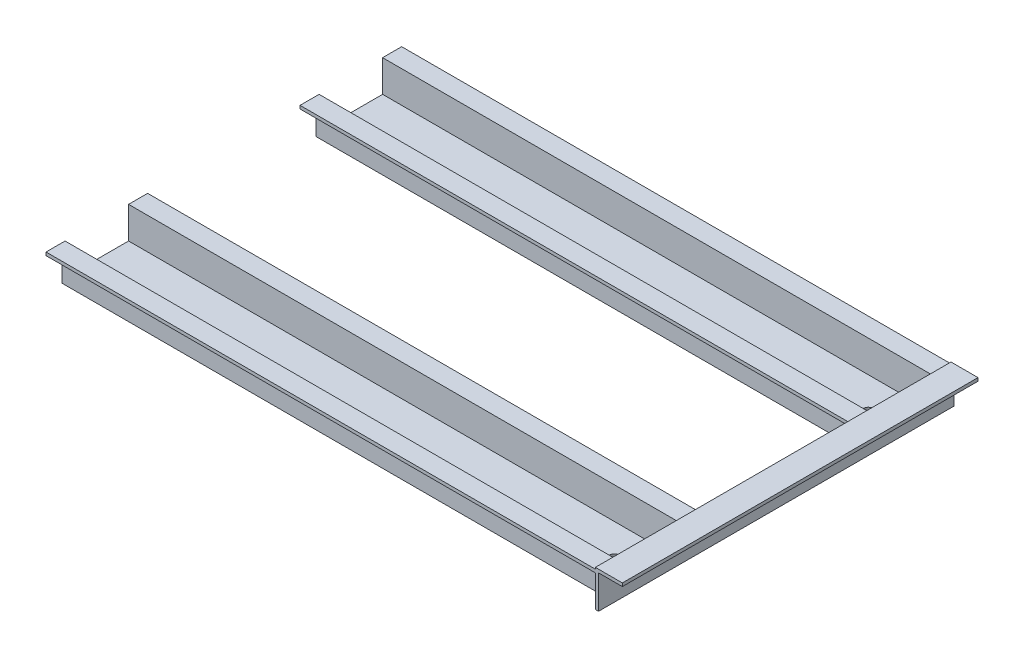
ISO-10303-21;
HEADER;
FILE_DESCRIPTION(('STEP AP214'),'2;1');
FILE_NAME('part.step','',(''),(''),'','','');
FILE_SCHEMA(('AUTOMOTIVE_DESIGN { 1 0 10303 214 1 1 1 1 }'));
ENDSEC;
DATA;
#1=APPLICATION_CONTEXT('core data for automotive mechanical design processes');
#2=APPLICATION_PROTOCOL_DEFINITION('international standard','automotive_design',2000,#1);
#3=PRODUCT_CONTEXT('',#1,'mechanical');
#4=PRODUCT('Part','Part','',(#3));
#5=PRODUCT_RELATED_PRODUCT_CATEGORY('part','',(#4));
#6=PRODUCT_DEFINITION_FORMATION('','',#4);
#7=PRODUCT_DEFINITION_CONTEXT('part definition',#1,'design');
#8=PRODUCT_DEFINITION('design','',#6,#7);
#9=PRODUCT_DEFINITION_SHAPE('','',#8);
#10=(LENGTH_UNIT() NAMED_UNIT(*) SI_UNIT(.MILLI.,.METRE.));
#11=(NAMED_UNIT(*) PLANE_ANGLE_UNIT() SI_UNIT($,.RADIAN.));
#12=(NAMED_UNIT(*) SI_UNIT($,.STERADIAN.) SOLID_ANGLE_UNIT());
#13=UNCERTAINTY_MEASURE_WITH_UNIT(LENGTH_MEASURE(1.E-05),#10,'distance_accuracy_value','');
#14=(GEOMETRIC_REPRESENTATION_CONTEXT(3) GLOBAL_UNCERTAINTY_ASSIGNED_CONTEXT((#13)) GLOBAL_UNIT_ASSIGNED_CONTEXT((#10,
#11,#12)) REPRESENTATION_CONTEXT('',''));
#15=CARTESIAN_POINT('',(0.,0.,0.));
#16=DIRECTION('',(0.,0.,1.));
#17=DIRECTION('',(1.,0.,0.));
#18=AXIS2_PLACEMENT_3D('',#15,#16,#17);
#19=CARTESIAN_POINT('',(0.,0.,0.));
#20=DIRECTION('',(1.,0.,0.));
#21=DIRECTION('',(0.,0.,-1.));
#22=AXIS2_PLACEMENT_3D('',#19,#20,#21);
#23=PLANE('',#22);
#24=DIRECTION('',(0.,-1.,0.));
#25=VECTOR('',#24,1.);
#26=CARTESIAN_POINT('',(0.,20.,112.));
#27=LINE('',#26,#25);
#28=CARTESIAN_POINT('',(0.,22.,112.));
#29=VERTEX_POINT('',#28);
#30=CARTESIAN_POINT('',(0.,20.,112.));
#31=VERTEX_POINT('',#30);
#32=EDGE_CURVE('E540',#29,#31,#27,.T.);
#33=ORIENTED_EDGE('',*,*,#32,.F.);
#34=DIRECTION('',(0.,0.,-1.));
#35=VECTOR('',#34,1.);
#36=CARTESIAN_POINT('',(0.,22.,112.));
#37=LINE('',#36,#35);
#38=CARTESIAN_POINT('',(0.,22.,100.));
#39=VERTEX_POINT('',#38);
#40=EDGE_CURVE('E307',#29,#39,#37,.T.);
#41=ORIENTED_EDGE('',*,*,#40,.T.);
#42=DIRECTION('',(0.,-1.,0.));
#43=VECTOR('',#42,1.);
#44=CARTESIAN_POINT('',(0.,20.,100.));
#45=LINE('',#44,#43);
#46=CARTESIAN_POINT('',(0.,1.99999999999997,100.));
#47=VERTEX_POINT('',#46);
#48=EDGE_CURVE('E421',#39,#47,#45,.T.);
#49=ORIENTED_EDGE('',*,*,#48,.T.);
#50=DIRECTION('',(0.,0.,-1.));
#51=VECTOR('',#50,1.);
#52=CARTESIAN_POINT('',(0.,1.99999999999997,102.));
#53=LINE('',#52,#51);
#54=CARTESIAN_POINT('',(0.,1.99999999999997,60.));
#55=VERTEX_POINT('',#54);
#56=EDGE_CURVE('E423',#47,#55,#53,.T.);
#57=ORIENTED_EDGE('',*,*,#56,.T.);
#58=DIRECTION('',(0.,1.,0.));
#59=VECTOR('',#58,1.);
#60=CARTESIAN_POINT('',(0.,20.,60.));
#61=LINE('',#60,#59);
#62=CARTESIAN_POINT('',(0.,22.,60.));
#63=VERTEX_POINT('',#62);
#64=EDGE_CURVE('E427',#55,#63,#61,.T.);
#65=ORIENTED_EDGE('',*,*,#64,.T.);
#66=DIRECTION('',(0.,0.,-1.));
#67=VECTOR('',#66,1.);
#68=CARTESIAN_POINT('',(0.,22.,48.));
#69=LINE('',#68,#67);
#70=CARTESIAN_POINT('',(0.,22.,48.));
#71=VERTEX_POINT('',#70);
#72=EDGE_CURVE('E556',#63,#71,#69,.T.);
#73=ORIENTED_EDGE('',*,*,#72,.T.);
#74=DIRECTION('',(0.,1.,0.));
#75=VECTOR('',#74,1.);
#76=CARTESIAN_POINT('',(0.,22.,48.));
#77=LINE('',#76,#75);
#78=CARTESIAN_POINT('',(0.,20.,48.));
#79=VERTEX_POINT('',#78);
#80=EDGE_CURVE('E553',#79,#71,#77,.T.);
#81=ORIENTED_EDGE('',*,*,#80,.F.);
#82=DIRECTION('',(0.,0.,-1.));
#83=VECTOR('',#82,1.);
#84=CARTESIAN_POINT('',(0.,20.,48.));
#85=LINE('',#84,#83);
#86=CARTESIAN_POINT('',(0.,20.,58.));
#87=VERTEX_POINT('',#86);
#88=EDGE_CURVE('E550',#87,#79,#85,.T.);
#89=ORIENTED_EDGE('',*,*,#88,.F.);
#90=DIRECTION('',(0.,1.,0.));
#91=VECTOR('',#90,1.);
#92=CARTESIAN_POINT('',(0.,20.,58.));
#93=LINE('',#92,#91);
#94=CARTESIAN_POINT('',(0.,0.,58.));
#95=VERTEX_POINT('',#94);
#96=EDGE_CURVE('E547',#95,#87,#93,.T.);
#97=ORIENTED_EDGE('',*,*,#96,.F.);
#98=DIRECTION('',(0.,0.,-1.));
#99=VECTOR('',#98,1.);
#100=CARTESIAN_POINT('',(0.,0.,102.));
#101=LINE('',#100,#99);
#102=CARTESIAN_POINT('',(0.,0.,102.));
#103=VERTEX_POINT('',#102);
#104=EDGE_CURVE('E546',#103,#95,#101,.T.);
#105=ORIENTED_EDGE('',*,*,#104,.F.);
#106=DIRECTION('',(0.,-1.,0.));
#107=VECTOR('',#106,1.);
#108=CARTESIAN_POINT('',(0.,20.,102.));
#109=LINE('',#108,#107);
#110=CARTESIAN_POINT('',(0.,20.,102.));
#111=VERTEX_POINT('',#110);
#112=EDGE_CURVE('E543',#111,#103,#109,.T.);
#113=ORIENTED_EDGE('',*,*,#112,.F.);
#114=DIRECTION('',(0.,0.,-1.));
#115=VECTOR('',#114,1.);
#116=CARTESIAN_POINT('',(0.,20.,112.));
#117=LINE('',#116,#115);
#118=EDGE_CURVE('E69',#31,#111,#117,.T.);
#119=ORIENTED_EDGE('',*,*,#118,.F.);
#120=EDGE_LOOP('',(#33,#41,#49,#57,#65,#73,#81,#89,#97,#105,#113,#119));
#121=FACE_BOUND('',#120,.T.);
#122=ADVANCED_FACE('F54',(#121),#23,.F.);
#123=CARTESIAN_POINT('',(-413.675697262755,22.,112.));
#124=DIRECTION('',(0.,1.,0.));
#125=DIRECTION('',(0.,0.,1.));
#126=AXIS2_PLACEMENT_3D('',#123,#124,#125);
#127=PLANE('',#126);
#128=ORIENTED_EDGE('',*,*,#40,.F.);
#129=DIRECTION('',(1.,0.,0.));
#130=VECTOR('',#129,1.);
#131=CARTESIAN_POINT('',(-413.675697262755,22.,112.));
#132=LINE('',#131,#130);
#133=CARTESIAN_POINT('',(346.000000000001,22.,112.));
#134=VERTEX_POINT('',#133);
#135=EDGE_CURVE('E268',#29,#134,#132,.T.);
#136=ORIENTED_EDGE('',*,*,#135,.T.);
#137=DIRECTION('',(0.,0.,1.));
#138=VECTOR('',#137,1.);
#139=CARTESIAN_POINT('',(346.000000000001,22.,112.));
#140=LINE('',#139,#138);
#141=CARTESIAN_POINT('',(346.000000000001,22.,100.));
#142=VERTEX_POINT('',#141);
#143=EDGE_CURVE('E306',#142,#134,#140,.T.);
#144=ORIENTED_EDGE('',*,*,#143,.F.);
#145=DIRECTION('',(1.,0.,0.));
#146=VECTOR('',#145,1.);
#147=CARTESIAN_POINT('',(-413.675697262755,22.,100.));
#148=LINE('',#147,#146);
#149=EDGE_CURVE('E278',#39,#142,#148,.T.);
#150=ORIENTED_EDGE('',*,*,#149,.F.);
#151=EDGE_LOOP('',(#128,#136,#144,#150));
#152=FACE_BOUND('',#151,.T.);
#153=ADVANCED_FACE('F56',(#152),#127,.T.);
#154=CARTESIAN_POINT('',(-413.675697262755,20.,100.));
#155=DIRECTION('',(0.,0.,-1.));
#156=DIRECTION('',(-1.,0.,0.));
#157=AXIS2_PLACEMENT_3D('',#154,#155,#156);
#158=PLANE('',#157);
#159=ORIENTED_EDGE('',*,*,#48,.F.);
#160=ORIENTED_EDGE('',*,*,#149,.T.);
#161=DIRECTION('',(0.,1.,0.));
#162=VECTOR('',#161,1.);
#163=CARTESIAN_POINT('',(346.000000000001,20.,100.));
#164=LINE('',#163,#162);
#165=CARTESIAN_POINT('',(346.000000000001,1.99999999999997,100.));
#166=VERTEX_POINT('',#165);
#167=EDGE_CURVE('E326',#166,#142,#164,.T.);
#168=ORIENTED_EDGE('',*,*,#167,.F.);
#169=DIRECTION('',(1.,0.,0.));
#170=VECTOR('',#169,1.);
#171=CARTESIAN_POINT('',(-413.675697262755,1.99999999999997,100.));
#172=LINE('',#171,#170);
#173=EDGE_CURVE('E280',#47,#166,#172,.T.);
#174=ORIENTED_EDGE('',*,*,#173,.F.);
#175=EDGE_LOOP('',(#159,#160,#168,#174));
#176=FACE_BOUND('',#175,.T.);
#177=ADVANCED_FACE('F420',(#176),#158,.T.);
#178=CARTESIAN_POINT('',(-413.675697262755,1.99999999999997,102.));
#179=DIRECTION('',(0.,1.,0.));
#180=DIRECTION('',(0.,0.,1.));
#181=AXIS2_PLACEMENT_3D('',#178,#179,#180);
#182=PLANE('',#181);
#183=ORIENTED_EDGE('',*,*,#56,.F.);
#184=ORIENTED_EDGE('',*,*,#173,.T.);
#185=DIRECTION('',(0.,0.,1.));
#186=VECTOR('',#185,1.);
#187=CARTESIAN_POINT('',(346.000000000001,1.99999999999997,102.));
#188=LINE('',#187,#186);
#189=CARTESIAN_POINT('',(346.,1.99999999999997,60.));
#190=VERTEX_POINT('',#189);
#191=EDGE_CURVE('E329',#190,#166,#188,.T.);
#192=ORIENTED_EDGE('',*,*,#191,.F.);
#193=DIRECTION('',(1.,0.,0.));
#194=VECTOR('',#193,1.);
#195=CARTESIAN_POINT('',(-413.675697262755,1.99999999999997,60.));
#196=LINE('',#195,#194);
#197=EDGE_CURVE('E282',#55,#190,#196,.T.);
#198=ORIENTED_EDGE('',*,*,#197,.F.);
#199=EDGE_LOOP('',(#183,#184,#192,#198));
#200=FACE_BOUND('',#199,.T.);
#201=CARTESIAN_POINT('',(326.,1.99999999999997,80.));
#202=DIRECTION('',(0.,-1.,0.));
#203=DIRECTION('',(0.,0.,1.));
#204=AXIS2_PLACEMENT_3D('',#201,#202,#203);
#205=CIRCLE('',#204,3.30000000000003);
#206=CARTESIAN_POINT('',(326.,1.99999999999997,83.3000000000001));
#207=VERTEX_POINT('',#206);
#208=EDGE_CURVE('E327',#207,#207,#205,.T.);
#209=ORIENTED_EDGE('',*,*,#208,.T.);
#210=EDGE_LOOP('',(#209));
#211=FACE_BOUND('',#210,.T.);
#212=ADVANCED_FACE('F566',(#200,#211),#182,.T.);
#213=CARTESIAN_POINT('',(-413.675697262755,20.,60.));
#214=DIRECTION('',(0.,0.,1.));
#215=DIRECTION('',(1.,0.,0.));
#216=AXIS2_PLACEMENT_3D('',#213,#214,#215);
#217=PLANE('',#216);
#218=ORIENTED_EDGE('',*,*,#64,.F.);
#219=ORIENTED_EDGE('',*,*,#197,.T.);
#220=DIRECTION('',(0.,-1.,0.));
#221=VECTOR('',#220,1.);
#222=CARTESIAN_POINT('',(346.,20.,60.));
#223=LINE('',#222,#221);
#224=CARTESIAN_POINT('',(346.,22.,60.));
#225=VERTEX_POINT('',#224);
#226=EDGE_CURVE('E411',#225,#190,#223,.T.);
#227=ORIENTED_EDGE('',*,*,#226,.F.);
#228=DIRECTION('',(1.,0.,0.));
#229=VECTOR('',#228,1.);
#230=CARTESIAN_POINT('',(-413.675697262755,22.,60.));
#231=LINE('',#230,#229);
#232=EDGE_CURVE('E284',#63,#225,#231,.T.);
#233=ORIENTED_EDGE('',*,*,#232,.F.);
#234=EDGE_LOOP('',(#218,#219,#227,#233));
#235=FACE_BOUND('',#234,.T.);
#236=ADVANCED_FACE('F565',(#235),#217,.T.);
#237=CARTESIAN_POINT('',(-413.675697262755,22.,48.));
#238=DIRECTION('',(0.,1.,0.));
#239=DIRECTION('',(0.,0.,1.));
#240=AXIS2_PLACEMENT_3D('',#237,#238,#239);
#241=PLANE('',#240);
#242=ORIENTED_EDGE('',*,*,#72,.F.);
#243=ORIENTED_EDGE('',*,*,#232,.T.);
#244=DIRECTION('',(0.,0.,1.));
#245=VECTOR('',#244,1.);
#246=CARTESIAN_POINT('',(346.,22.,48.0000000000005));
#247=LINE('',#246,#245);
#248=CARTESIAN_POINT('',(346.,22.,48.));
#249=VERTEX_POINT('',#248);
#250=EDGE_CURVE('E408',#249,#225,#247,.T.);
#251=ORIENTED_EDGE('',*,*,#250,.F.);
#252=DIRECTION('',(1.,0.,0.));
#253=VECTOR('',#252,1.);
#254=CARTESIAN_POINT('',(-413.675697262755,22.,48.));
#255=LINE('',#254,#253);
#256=EDGE_CURVE('E286',#71,#249,#255,.T.);
#257=ORIENTED_EDGE('',*,*,#256,.F.);
#258=EDGE_LOOP('',(#242,#243,#251,#257));
#259=FACE_BOUND('',#258,.T.);
#260=ADVANCED_FACE('F563',(#259),#241,.T.);
#261=CARTESIAN_POINT('',(-413.675697262755,22.,48.));
#262=DIRECTION('',(0.,0.,1.));
#263=DIRECTION('',(1.,0.,0.));
#264=AXIS2_PLACEMENT_3D('',#261,#262,#263);
#265=PLANE('',#264);
#266=DIRECTION('',(1.,0.,0.));
#267=VECTOR('',#266,1.);
#268=CARTESIAN_POINT('',(-413.675697262755,20.,48.));
#269=LINE('',#268,#267);
#270=CARTESIAN_POINT('',(346.,20.,48.));
#271=VERTEX_POINT('',#270);
#272=EDGE_CURVE('E288',#79,#271,#269,.T.);
#273=ORIENTED_EDGE('',*,*,#272,.F.);
#274=ORIENTED_EDGE('',*,*,#80,.T.);
#275=ORIENTED_EDGE('',*,*,#256,.T.);
#276=DIRECTION('',(0.,-1.,0.));
#277=VECTOR('',#276,1.);
#278=CARTESIAN_POINT('',(346.,22.,48.));
#279=LINE('',#278,#277);
#280=EDGE_CURVE('E405',#249,#271,#279,.T.);
#281=ORIENTED_EDGE('',*,*,#280,.T.);
#282=EDGE_LOOP('',(#273,#274,#275,#281));
#283=FACE_BOUND('',#282,.T.);
#284=ADVANCED_FACE('F649',(#283),#265,.F.);
#285=CARTESIAN_POINT('',(-413.675697262755,20.,48.));
#286=DIRECTION('',(0.,1.,0.));
#287=DIRECTION('',(0.,0.,1.));
#288=AXIS2_PLACEMENT_3D('',#285,#286,#287);
#289=PLANE('',#288);
#290=DIRECTION('',(1.,0.,0.));
#291=VECTOR('',#290,1.);
#292=CARTESIAN_POINT('',(-413.675697262755,20.,58.));
#293=LINE('',#292,#291);
#294=CARTESIAN_POINT('',(346.,20.,58.));
#295=VERTEX_POINT('',#294);
#296=EDGE_CURVE('E290',#87,#295,#293,.T.);
#297=ORIENTED_EDGE('',*,*,#296,.F.);
#298=ORIENTED_EDGE('',*,*,#88,.T.);
#299=ORIENTED_EDGE('',*,*,#272,.T.);
#300=DIRECTION('',(0.,0.,1.));
#301=VECTOR('',#300,1.);
#302=CARTESIAN_POINT('',(346.,20.,48.0000000000005));
#303=LINE('',#302,#301);
#304=EDGE_CURVE('E402',#271,#295,#303,.T.);
#305=ORIENTED_EDGE('',*,*,#304,.T.);
#306=EDGE_LOOP('',(#297,#298,#299,#305));
#307=FACE_BOUND('',#306,.T.);
#308=ADVANCED_FACE('F645',(#307),#289,.F.);
#309=CARTESIAN_POINT('',(-413.675697262755,20.,58.));
#310=DIRECTION('',(0.,0.,1.));
#311=DIRECTION('',(1.,0.,0.));
#312=AXIS2_PLACEMENT_3D('',#309,#310,#311);
#313=PLANE('',#312);
#314=DIRECTION('',(1.,0.,0.));
#315=VECTOR('',#314,1.);
#316=CARTESIAN_POINT('',(-413.675697262755,0.,58.));
#317=LINE('',#316,#315);
#318=CARTESIAN_POINT('',(346.000000000001,0.,58.));
#319=VERTEX_POINT('',#318);
#320=EDGE_CURVE('E292',#95,#319,#317,.T.);
#321=ORIENTED_EDGE('',*,*,#320,.F.);
#322=ORIENTED_EDGE('',*,*,#96,.T.);
#323=ORIENTED_EDGE('',*,*,#296,.T.);
#324=DIRECTION('',(0.,-1.,0.));
#325=VECTOR('',#324,1.);
#326=CARTESIAN_POINT('',(346.,20.,58.));
#327=LINE('',#326,#325);
#328=EDGE_CURVE('E400',#295,#319,#327,.T.);
#329=ORIENTED_EDGE('',*,*,#328,.T.);
#330=EDGE_LOOP('',(#321,#322,#323,#329));
#331=FACE_BOUND('',#330,.T.);
#332=ADVANCED_FACE('F581',(#331),#313,.F.);
#333=CARTESIAN_POINT('',(-413.675697262755,0.,102.));
#334=DIRECTION('',(0.,1.,0.));
#335=DIRECTION('',(0.,0.,1.));
#336=AXIS2_PLACEMENT_3D('',#333,#334,#335);
#337=PLANE('',#336);
#338=DIRECTION('',(1.,0.,0.));
#339=VECTOR('',#338,1.);
#340=CARTESIAN_POINT('',(-413.675697262755,0.,102.));
#341=LINE('',#340,#339);
#342=CARTESIAN_POINT('',(346.000000000001,0.,102.));
#343=VERTEX_POINT('',#342);
#344=EDGE_CURVE('E294',#103,#343,#341,.T.);
#345=ORIENTED_EDGE('',*,*,#344,.F.);
#346=ORIENTED_EDGE('',*,*,#104,.T.);
#347=ORIENTED_EDGE('',*,*,#320,.T.);
#348=DIRECTION('',(0.,0.,1.));
#349=VECTOR('',#348,1.);
#350=CARTESIAN_POINT('',(345.999999999999,0.,-112.));
#351=LINE('',#350,#349);
#352=CARTESIAN_POINT('',(346.000000000001,0.,-58.));
#353=VERTEX_POINT('',#352);
#354=EDGE_CURVE('E362',#353,#319,#351,.T.);
#355=ORIENTED_EDGE('',*,*,#354,.F.);
#356=DIRECTION('',(1.,0.,0.));
#357=VECTOR('',#356,1.);
#358=CARTESIAN_POINT('',(-413.675697262755,0.,-58.));
#359=LINE('',#358,#357);
#360=CARTESIAN_POINT('',(0.,0.,-58.));
#361=VERTEX_POINT('',#360);
#362=EDGE_CURVE('E270',#361,#353,#359,.T.);
#363=ORIENTED_EDGE('',*,*,#362,.F.);
#364=CARTESIAN_POINT('',(0.,0.,-102.));
#365=VERTEX_POINT('',#364);
#366=EDGE_CURVE('E530',#361,#365,#101,.T.);
#367=ORIENTED_EDGE('',*,*,#366,.T.);
#368=DIRECTION('',(1.,0.,0.));
#369=VECTOR('',#368,1.);
#370=CARTESIAN_POINT('',(-413.675697262755,0.,-102.));
#371=LINE('',#370,#369);
#372=CARTESIAN_POINT('',(346.000000000001,0.,-102.));
#373=VERTEX_POINT('',#372);
#374=EDGE_CURVE('E260',#365,#373,#371,.T.);
#375=ORIENTED_EDGE('',*,*,#374,.T.);
#376=CARTESIAN_POINT('',(345.999999999999,0.,-112.));
#377=VERTEX_POINT('',#376);
#378=EDGE_CURVE('E319',#377,#373,#351,.T.);
#379=ORIENTED_EDGE('',*,*,#378,.F.);
#380=DIRECTION('',(-1.,0.,0.));
#381=VECTOR('',#380,1.);
#382=CARTESIAN_POINT('',(347.999999999999,0.,-112.));
#383=LINE('',#382,#381);
#384=CARTESIAN_POINT('',(347.999999999999,0.,-112.));
#385=VERTEX_POINT('',#384);
#386=EDGE_CURVE('E389',#385,#377,#383,.T.);
#387=ORIENTED_EDGE('',*,*,#386,.F.);
#388=DIRECTION('',(0.,0.,1.));
#389=VECTOR('',#388,1.);
#390=CARTESIAN_POINT('',(347.999999999999,0.,-112.));
#391=LINE('',#390,#389);
#392=CARTESIAN_POINT('',(348.000000000001,0.,112.));
#393=VERTEX_POINT('',#392);
#394=EDGE_CURVE('E476',#385,#393,#391,.T.);
#395=ORIENTED_EDGE('',*,*,#394,.T.);
#396=DIRECTION('',(-1.,0.,0.));
#397=VECTOR('',#396,1.);
#398=CARTESIAN_POINT('',(348.000000000001,0.,112.));
#399=LINE('',#398,#397);
#400=CARTESIAN_POINT('',(346.000000000001,0.,112.));
#401=VERTEX_POINT('',#400);
#402=EDGE_CURVE('E385',#393,#401,#399,.T.);
#403=ORIENTED_EDGE('',*,*,#402,.T.);
#404=EDGE_CURVE('E374',#343,#401,#351,.T.);
#405=ORIENTED_EDGE('',*,*,#404,.F.);
#406=EDGE_LOOP('',(#345,#346,#347,#355,#363,#367,#375,#379,#387,#395,#403,#405));
#407=FACE_BOUND('',#406,.T.);
#408=CARTESIAN_POINT('',(326.,0.,80.));
#409=DIRECTION('',(0.,-1.,0.));
#410=DIRECTION('',(0.,0.,1.));
#411=AXIS2_PLACEMENT_3D('',#408,#409,#410);
#412=CIRCLE('',#411,3.30000000000003);
#413=CARTESIAN_POINT('',(326.,0.,83.3000000000001));
#414=VERTEX_POINT('',#413);
#415=EDGE_CURVE('E332',#414,#414,#412,.T.);
#416=ORIENTED_EDGE('',*,*,#415,.F.);
#417=EDGE_LOOP('',(#416));
#418=FACE_BOUND('',#417,.T.);
#419=CARTESIAN_POINT('',(326.,0.,-80.));
#420=DIRECTION('',(0.,1.,0.));
#421=DIRECTION('',(0.,0.,-1.));
#422=AXIS2_PLACEMENT_3D('',#419,#420,#421);
#423=CIRCLE('',#422,3.30000000000003);
#424=CARTESIAN_POINT('',(326.,0.,-83.3000000000001));
#425=VERTEX_POINT('',#424);
#426=EDGE_CURVE('E448',#425,#425,#423,.T.);
#427=ORIENTED_EDGE('',*,*,#426,.T.);
#428=EDGE_LOOP('',(#427));
#429=FACE_BOUND('',#428,.T.);
#430=ADVANCED_FACE('F370',(#407,#418,#429),#337,.F.);
#431=CARTESIAN_POINT('',(-413.675697262755,20.,102.));
#432=DIRECTION('',(0.,0.,-1.));
#433=DIRECTION('',(-1.,0.,0.));
#434=AXIS2_PLACEMENT_3D('',#431,#432,#433);
#435=PLANE('',#434);
#436=DIRECTION('',(1.,0.,0.));
#437=VECTOR('',#436,1.);
#438=CARTESIAN_POINT('',(-413.675697262755,20.,102.));
#439=LINE('',#438,#437);
#440=CARTESIAN_POINT('',(346.000000000001,20.,102.));
#441=VERTEX_POINT('',#440);
#442=EDGE_CURVE('E295',#111,#441,#439,.T.);
#443=ORIENTED_EDGE('',*,*,#442,.F.);
#444=ORIENTED_EDGE('',*,*,#112,.T.);
#445=ORIENTED_EDGE('',*,*,#344,.T.);
#446=DIRECTION('',(0.,1.,0.));
#447=VECTOR('',#446,1.);
#448=CARTESIAN_POINT('',(346.000000000001,20.,102.));
#449=LINE('',#448,#447);
#450=EDGE_CURVE('E397',#343,#441,#449,.T.);
#451=ORIENTED_EDGE('',*,*,#450,.T.);
#452=EDGE_LOOP('',(#443,#444,#445,#451));
#453=FACE_BOUND('',#452,.T.);
#454=ADVANCED_FACE('F580',(#453),#435,.F.);
#455=CARTESIAN_POINT('',(-413.675697262755,20.,112.));
#456=DIRECTION('',(0.,1.,0.));
#457=DIRECTION('',(0.,0.,1.));
#458=AXIS2_PLACEMENT_3D('',#455,#456,#457);
#459=PLANE('',#458);
#460=DIRECTION('',(1.,0.,0.));
#461=VECTOR('',#460,1.);
#462=CARTESIAN_POINT('',(-413.675697262755,20.,112.));
#463=LINE('',#462,#461);
#464=CARTESIAN_POINT('',(346.000000000001,20.,112.));
#465=VERTEX_POINT('',#464);
#466=EDGE_CURVE('E62',#31,#465,#463,.T.);
#467=ORIENTED_EDGE('',*,*,#466,.F.);
#468=ORIENTED_EDGE('',*,*,#118,.T.);
#469=ORIENTED_EDGE('',*,*,#442,.T.);
#470=DIRECTION('',(0.,0.,1.));
#471=VECTOR('',#470,1.);
#472=CARTESIAN_POINT('',(346.000000000001,20.,112.));
#473=LINE('',#472,#471);
#474=EDGE_CURVE('E277',#441,#465,#473,.T.);
#475=ORIENTED_EDGE('',*,*,#474,.T.);
#476=EDGE_LOOP('',(#467,#468,#469,#475));
#477=FACE_BOUND('',#476,.T.);
#478=ADVANCED_FACE('F633',(#477),#459,.F.);
#479=CARTESIAN_POINT('',(-413.675697262755,20.,112.));
#480=DIRECTION('',(0.,0.,-1.));
#481=DIRECTION('',(-1.,0.,0.));
#482=AXIS2_PLACEMENT_3D('',#479,#480,#481);
#483=PLANE('',#482);
#484=ORIENTED_EDGE('',*,*,#135,.F.);
#485=ORIENTED_EDGE('',*,*,#32,.T.);
#486=ORIENTED_EDGE('',*,*,#466,.T.);
#487=DIRECTION('',(0.,1.,0.));
#488=VECTOR('',#487,1.);
#489=CARTESIAN_POINT('',(346.000000000001,23.,112.));
#490=LINE('',#489,#488);
#491=EDGE_CURVE('E318',#401,#465,#490,.T.);
#492=ORIENTED_EDGE('',*,*,#491,.F.);
#493=ORIENTED_EDGE('',*,*,#402,.F.);
#494=DIRECTION('',(0.,1.,0.));
#495=VECTOR('',#494,1.);
#496=CARTESIAN_POINT('',(348.000000000001,23.,112.));
#497=LINE('',#496,#495);
#498=CARTESIAN_POINT('',(348.000000000001,21.,112.));
#499=VERTEX_POINT('',#498);
#500=EDGE_CURVE('E386',#393,#499,#497,.T.);
#501=ORIENTED_EDGE('',*,*,#500,.T.);
#502=DIRECTION('',(-1.,0.,0.));
#503=VECTOR('',#502,1.);
#504=CARTESIAN_POINT('',(363.000000000001,21.,112.));
#505=LINE('',#504,#503);
#506=CARTESIAN_POINT('',(363.000000000001,21.,112.));
#507=VERTEX_POINT('',#506);
#508=EDGE_CURVE('E441',#507,#499,#505,.T.);
#509=ORIENTED_EDGE('',*,*,#508,.F.);
#510=DIRECTION('',(0.,-1.,0.));
#511=VECTOR('',#510,1.);
#512=CARTESIAN_POINT('',(363.000000000001,23.,112.));
#513=LINE('',#512,#511);
#514=CARTESIAN_POINT('',(363.000000000001,23.,112.));
#515=VERTEX_POINT('',#514);
#516=EDGE_CURVE('E438',#515,#507,#513,.T.);
#517=ORIENTED_EDGE('',*,*,#516,.F.);
#518=DIRECTION('',(-1.,0.,0.));
#519=VECTOR('',#518,1.);
#520=CARTESIAN_POINT('',(348.000000000001,23.,112.));
#521=LINE('',#520,#519);
#522=CARTESIAN_POINT('',(346.000000000001,23.,112.));
#523=VERTEX_POINT('',#522);
#524=EDGE_CURVE('E315',#515,#523,#521,.T.);
#525=ORIENTED_EDGE('',*,*,#524,.T.);
#526=EDGE_CURVE('E311',#134,#523,#490,.T.);
#527=ORIENTED_EDGE('',*,*,#526,.F.);
#528=EDGE_LOOP('',(#484,#485,#486,#492,#493,#501,#509,#517,#525,#527));
#529=FACE_BOUND('',#528,.T.);
#530=ADVANCED_FACE('F312',(#529),#483,.F.);
#531=CARTESIAN_POINT('',(-347.999999999999,23.,-112.));
#532=DIRECTION('',(0.,0.,1.));
#533=DIRECTION('',(1.,0.,0.));
#534=AXIS2_PLACEMENT_3D('',#531,#532,#533);
#535=PLANE('',#534);
#536=DIRECTION('',(1.,0.,0.));
#537=VECTOR('',#536,1.);
#538=CARTESIAN_POINT('',(-413.675697262755,20.,-112.));
#539=LINE('',#538,#537);
#540=CARTESIAN_POINT('',(0.,20.,-112.));
#541=VERTEX_POINT('',#540);
#542=CARTESIAN_POINT('',(345.999999999999,20.,-112.));
#543=VERTEX_POINT('',#542);
#544=EDGE_CURVE('E266',#541,#543,#539,.T.);
#545=ORIENTED_EDGE('',*,*,#544,.F.);
#546=DIRECTION('',(0.,1.,0.));
#547=VECTOR('',#546,1.);
#548=CARTESIAN_POINT('',(0.,23.,-111.999999999998));
#549=LINE('',#548,#547);
#550=CARTESIAN_POINT('',(0.,22.,-111.999999999998));
#551=VERTEX_POINT('',#550);
#552=EDGE_CURVE('E77',#541,#551,#549,.T.);
#553=ORIENTED_EDGE('',*,*,#552,.T.);
#554=DIRECTION('',(1.,0.,0.));
#555=VECTOR('',#554,1.);
#556=CARTESIAN_POINT('',(-413.675697262755,22.,-112.));
#557=LINE('',#556,#555);
#558=CARTESIAN_POINT('',(346.000000000001,22.,-112.));
#559=VERTEX_POINT('',#558);
#560=EDGE_CURVE('E274',#551,#559,#557,.T.);
#561=ORIENTED_EDGE('',*,*,#560,.T.);
#562=DIRECTION('',(0.,-1.,0.));
#563=VECTOR('',#562,1.);
#564=CARTESIAN_POINT('',(345.999999999999,23.,-112.));
#565=LINE('',#564,#563);
#566=CARTESIAN_POINT('',(345.999999999999,23.,-112.));
#567=VERTEX_POINT('',#566);
#568=EDGE_CURVE('E378',#567,#559,#565,.T.);
#569=ORIENTED_EDGE('',*,*,#568,.F.);
#570=DIRECTION('',(-1.,0.,0.));
#571=VECTOR('',#570,1.);
#572=CARTESIAN_POINT('',(347.999999999999,23.,-112.));
#573=LINE('',#572,#571);
#574=CARTESIAN_POINT('',(362.999999999999,23.,-112.));
#575=VERTEX_POINT('',#574);
#576=EDGE_CURVE('E391',#575,#567,#573,.T.);
#577=ORIENTED_EDGE('',*,*,#576,.F.);
#578=DIRECTION('',(0.,1.,0.));
#579=VECTOR('',#578,1.);
#580=CARTESIAN_POINT('',(362.999999999999,21.,-112.));
#581=LINE('',#580,#579);
#582=CARTESIAN_POINT('',(362.999999999999,21.,-112.));
#583=VERTEX_POINT('',#582);
#584=EDGE_CURVE('E434',#583,#575,#581,.T.);
#585=ORIENTED_EDGE('',*,*,#584,.F.);
#586=DIRECTION('',(-1.,0.,0.));
#587=VECTOR('',#586,1.);
#588=CARTESIAN_POINT('',(362.999999999999,21.,-112.));
#589=LINE('',#588,#587);
#590=CARTESIAN_POINT('',(347.999999999999,21.,-112.));
#591=VERTEX_POINT('',#590);
#592=EDGE_CURVE('E445',#583,#591,#589,.T.);
#593=ORIENTED_EDGE('',*,*,#592,.T.);
#594=DIRECTION('',(0.,-1.,0.));
#595=VECTOR('',#594,1.);
#596=CARTESIAN_POINT('',(347.999999999999,23.,-112.));
#597=LINE('',#596,#595);
#598=EDGE_CURVE('E383',#591,#385,#597,.T.);
#599=ORIENTED_EDGE('',*,*,#598,.T.);
#600=ORIENTED_EDGE('',*,*,#386,.T.);
#601=EDGE_CURVE('E480',#543,#377,#565,.T.);
#602=ORIENTED_EDGE('',*,*,#601,.F.);
#603=EDGE_LOOP('',(#545,#553,#561,#569,#577,#585,#593,#599,#600,#602));
#604=FACE_BOUND('',#603,.T.);
#605=ADVANCED_FACE('F624',(#604),#535,.F.);
#606=CARTESIAN_POINT('',(-413.675697262755,22.,-112.));
#607=DIRECTION('',(0.,1.,0.));
#608=DIRECTION('',(0.,0.,-1.));
#609=AXIS2_PLACEMENT_3D('',#606,#607,#608);
#610=PLANE('',#609);
#611=DIRECTION('',(0.,0.,-1.));
#612=VECTOR('',#611,1.);
#613=CARTESIAN_POINT('',(0.,22.,-112.));
#614=LINE('',#613,#612);
#615=CARTESIAN_POINT('',(0.,22.,-100.));
#616=VERTEX_POINT('',#615);
#617=EDGE_CURVE('E494',#616,#551,#614,.T.);
#618=ORIENTED_EDGE('',*,*,#617,.F.);
#619=DIRECTION('',(1.,0.,0.));
#620=VECTOR('',#619,1.);
#621=CARTESIAN_POINT('',(-413.675697262755,22.,-100.));
#622=LINE('',#621,#620);
#623=CARTESIAN_POINT('',(346.000000000001,22.,-100.));
#624=VERTEX_POINT('',#623);
#625=EDGE_CURVE('E276',#616,#624,#622,.T.);
#626=ORIENTED_EDGE('',*,*,#625,.T.);
#627=DIRECTION('',(0.,0.,-1.));
#628=VECTOR('',#627,1.);
#629=CARTESIAN_POINT('',(346.000000000001,22.,-112.));
#630=LINE('',#629,#628);
#631=EDGE_CURVE('E454',#624,#559,#630,.T.);
#632=ORIENTED_EDGE('',*,*,#631,.T.);
#633=ORIENTED_EDGE('',*,*,#560,.F.);
#634=EDGE_LOOP('',(#618,#626,#632,#633));
#635=FACE_BOUND('',#634,.T.);
#636=ADVANCED_FACE('F492',(#635),#610,.T.);
#637=CARTESIAN_POINT('',(-413.675697262755,20.,-100.));
#638=DIRECTION('',(0.,0.,1.));
#639=DIRECTION('',(-1.,0.,0.));
#640=AXIS2_PLACEMENT_3D('',#637,#638,#639);
#641=PLANE('',#640);
#642=DIRECTION('',(0.,1.,0.));
#643=VECTOR('',#642,1.);
#644=CARTESIAN_POINT('',(0.,20.,-100.));
#645=LINE('',#644,#643);
#646=CARTESIAN_POINT('',(0.,1.99999999999997,-100.));
#647=VERTEX_POINT('',#646);
#648=EDGE_CURVE('E537',#647,#616,#645,.T.);
#649=ORIENTED_EDGE('',*,*,#648,.F.);
#650=DIRECTION('',(1.,0.,0.));
#651=VECTOR('',#650,1.);
#652=CARTESIAN_POINT('',(-413.675697262755,1.99999999999997,-100.));
#653=LINE('',#652,#651);
#654=CARTESIAN_POINT('',(346.000000000001,1.99999999999997,-100.));
#655=VERTEX_POINT('',#654);
#656=EDGE_CURVE('E337',#647,#655,#653,.T.);
#657=ORIENTED_EDGE('',*,*,#656,.T.);
#658=DIRECTION('',(0.,1.,0.));
#659=VECTOR('',#658,1.);
#660=CARTESIAN_POINT('',(346.000000000001,20.,-100.));
#661=LINE('',#660,#659);
#662=EDGE_CURVE('E470',#655,#624,#661,.T.);
#663=ORIENTED_EDGE('',*,*,#662,.T.);
#664=ORIENTED_EDGE('',*,*,#625,.F.);
#665=EDGE_LOOP('',(#649,#657,#663,#664));
#666=FACE_BOUND('',#665,.T.);
#667=ADVANCED_FACE('F497',(#666),#641,.T.);
#668=CARTESIAN_POINT('',(-413.675697262755,1.99999999999997,-102.));
#669=DIRECTION('',(0.,1.,0.));
#670=DIRECTION('',(0.,0.,-1.));
#671=AXIS2_PLACEMENT_3D('',#668,#669,#670);
#672=PLANE('',#671);
#673=DIRECTION('',(0.,0.,-1.));
#674=VECTOR('',#673,1.);
#675=CARTESIAN_POINT('',(0.,1.99999999999997,-102.));
#676=LINE('',#675,#674);
#677=CARTESIAN_POINT('',(0.,1.99999999999997,-60.));
#678=VERTEX_POINT('',#677);
#679=EDGE_CURVE('E507',#678,#647,#676,.T.);
#680=ORIENTED_EDGE('',*,*,#679,.F.);
#681=DIRECTION('',(1.,0.,0.));
#682=VECTOR('',#681,1.);
#683=CARTESIAN_POINT('',(-413.675697262755,1.99999999999997,-60.));
#684=LINE('',#683,#682);
#685=CARTESIAN_POINT('',(346.,1.99999999999997,-60.));
#686=VERTEX_POINT('',#685);
#687=EDGE_CURVE('E339',#678,#686,#684,.T.);
#688=ORIENTED_EDGE('',*,*,#687,.T.);
#689=DIRECTION('',(0.,0.,-1.));
#690=VECTOR('',#689,1.);
#691=CARTESIAN_POINT('',(346.000000000001,1.99999999999997,-102.));
#692=LINE('',#691,#690);
#693=EDGE_CURVE('E467',#686,#655,#692,.T.);
#694=ORIENTED_EDGE('',*,*,#693,.T.);
#695=ORIENTED_EDGE('',*,*,#656,.F.);
#696=EDGE_LOOP('',(#680,#688,#694,#695));
#697=FACE_BOUND('',#696,.T.);
#698=CARTESIAN_POINT('',(326.,1.99999999999997,-80.));
#699=DIRECTION('',(0.,1.,0.));
#700=DIRECTION('',(0.,0.,-1.));
#701=AXIS2_PLACEMENT_3D('',#698,#699,#700);
#702=CIRCLE('',#701,3.30000000000003);
#703=CARTESIAN_POINT('',(326.,1.99999999999997,-83.3000000000001));
#704=VERTEX_POINT('',#703);
#705=EDGE_CURVE('E451',#704,#704,#702,.T.);
#706=ORIENTED_EDGE('',*,*,#705,.F.);
#707=EDGE_LOOP('',(#706));
#708=FACE_BOUND('',#707,.T.);
#709=ADVANCED_FACE('F504',(#697,#708),#672,.T.);
#710=CARTESIAN_POINT('',(-413.675697262755,20.,-60.));
#711=DIRECTION('',(0.,0.,-1.));
#712=DIRECTION('',(1.,0.,0.));
#713=AXIS2_PLACEMENT_3D('',#710,#711,#712);
#714=PLANE('',#713);
#715=DIRECTION('',(0.,-1.,0.));
#716=VECTOR('',#715,1.);
#717=CARTESIAN_POINT('',(0.,20.,-60.));
#718=LINE('',#717,#716);
#719=CARTESIAN_POINT('',(0.,22.,-60.));
#720=VERTEX_POINT('',#719);
#721=EDGE_CURVE('E512',#720,#678,#718,.T.);
#722=ORIENTED_EDGE('',*,*,#721,.F.);
#723=DIRECTION('',(1.,0.,0.));
#724=VECTOR('',#723,1.);
#725=CARTESIAN_POINT('',(-413.675697262755,22.,-60.));
#726=LINE('',#725,#724);
#727=CARTESIAN_POINT('',(346.,22.,-60.));
#728=VERTEX_POINT('',#727);
#729=EDGE_CURVE('E341',#720,#728,#726,.T.);
#730=ORIENTED_EDGE('',*,*,#729,.T.);
#731=DIRECTION('',(0.,-1.,0.));
#732=VECTOR('',#731,1.);
#733=CARTESIAN_POINT('',(346.,20.,-60.));
#734=LINE('',#733,#732);
#735=EDGE_CURVE('E464',#728,#686,#734,.T.);
#736=ORIENTED_EDGE('',*,*,#735,.T.);
#737=ORIENTED_EDGE('',*,*,#687,.F.);
#738=EDGE_LOOP('',(#722,#730,#736,#737));
#739=FACE_BOUND('',#738,.T.);
#740=ADVANCED_FACE('F510',(#739),#714,.T.);
#741=CARTESIAN_POINT('',(-413.675697262755,22.,-48.));
#742=DIRECTION('',(0.,1.,0.));
#743=DIRECTION('',(0.,0.,-1.));
#744=AXIS2_PLACEMENT_3D('',#741,#742,#743);
#745=PLANE('',#744);
#746=DIRECTION('',(0.,0.,-1.));
#747=VECTOR('',#746,1.);
#748=CARTESIAN_POINT('',(0.,22.,-48.));
#749=LINE('',#748,#747);
#750=CARTESIAN_POINT('',(0.,22.,-48.));
#751=VERTEX_POINT('',#750);
#752=EDGE_CURVE('E528',#751,#720,#749,.T.);
#753=ORIENTED_EDGE('',*,*,#752,.F.);
#754=DIRECTION('',(1.,0.,0.));
#755=VECTOR('',#754,1.);
#756=CARTESIAN_POINT('',(-413.675697262755,22.,-48.));
#757=LINE('',#756,#755);
#758=CARTESIAN_POINT('',(346.,22.,-48.));
#759=VERTEX_POINT('',#758);
#760=EDGE_CURVE('E343',#751,#759,#757,.T.);
#761=ORIENTED_EDGE('',*,*,#760,.T.);
#762=DIRECTION('',(0.,0.,-1.));
#763=VECTOR('',#762,1.);
#764=CARTESIAN_POINT('',(346.,22.,-48.0000000000005));
#765=LINE('',#764,#763);
#766=EDGE_CURVE('E461',#759,#728,#765,.T.);
#767=ORIENTED_EDGE('',*,*,#766,.T.);
#768=ORIENTED_EDGE('',*,*,#729,.F.);
#769=EDGE_LOOP('',(#753,#761,#767,#768));
#770=FACE_BOUND('',#769,.T.);
#771=ADVANCED_FACE('F515',(#770),#745,.T.);
#772=CARTESIAN_POINT('',(-413.675697262755,22.,-48.));
#773=DIRECTION('',(0.,0.,-1.));
#774=DIRECTION('',(1.,0.,0.));
#775=AXIS2_PLACEMENT_3D('',#772,#773,#774);
#776=PLANE('',#775);
#777=ORIENTED_EDGE('',*,*,#760,.F.);
#778=DIRECTION('',(0.,-1.,0.));
#779=VECTOR('',#778,1.);
#780=CARTESIAN_POINT('',(0.,22.,-48.));
#781=LINE('',#780,#779);
#782=CARTESIAN_POINT('',(0.,20.,-48.));
#783=VERTEX_POINT('',#782);
#784=EDGE_CURVE('E522',#751,#783,#781,.T.);
#785=ORIENTED_EDGE('',*,*,#784,.T.);
#786=DIRECTION('',(1.,0.,0.));
#787=VECTOR('',#786,1.);
#788=CARTESIAN_POINT('',(-413.675697262755,20.,-48.));
#789=LINE('',#788,#787);
#790=CARTESIAN_POINT('',(346.,20.,-48.));
#791=VERTEX_POINT('',#790);
#792=EDGE_CURVE('E345',#783,#791,#789,.T.);
#793=ORIENTED_EDGE('',*,*,#792,.T.);
#794=DIRECTION('',(0.,-1.,0.));
#795=VECTOR('',#794,1.);
#796=CARTESIAN_POINT('',(346.,22.,-48.));
#797=LINE('',#796,#795);
#798=EDGE_CURVE('E459',#759,#791,#797,.T.);
#799=ORIENTED_EDGE('',*,*,#798,.F.);
#800=EDGE_LOOP('',(#777,#785,#793,#799));
#801=FACE_BOUND('',#800,.T.);
#802=ADVANCED_FACE('F519',(#801),#776,.F.);
#803=CARTESIAN_POINT('',(-413.675697262755,20.,-48.));
#804=DIRECTION('',(0.,1.,0.));
#805=DIRECTION('',(0.,0.,-1.));
#806=AXIS2_PLACEMENT_3D('',#803,#804,#805);
#807=PLANE('',#806);
#808=ORIENTED_EDGE('',*,*,#792,.F.);
#809=DIRECTION('',(0.,0.,-1.));
#810=VECTOR('',#809,1.);
#811=CARTESIAN_POINT('',(0.,20.,-48.));
#812=LINE('',#811,#810);
#813=CARTESIAN_POINT('',(0.,20.,-58.));
#814=VERTEX_POINT('',#813);
#815=EDGE_CURVE('E526',#783,#814,#812,.T.);
#816=ORIENTED_EDGE('',*,*,#815,.T.);
#817=DIRECTION('',(1.,0.,0.));
#818=VECTOR('',#817,1.);
#819=CARTESIAN_POINT('',(-413.675697262755,20.,-58.));
#820=LINE('',#819,#818);
#821=CARTESIAN_POINT('',(346.,20.,-58.));
#822=VERTEX_POINT('',#821);
#823=EDGE_CURVE('E347',#814,#822,#820,.T.);
#824=ORIENTED_EDGE('',*,*,#823,.T.);
#825=DIRECTION('',(0.,0.,-1.));
#826=VECTOR('',#825,1.);
#827=CARTESIAN_POINT('',(346.,20.,-48.0000000000005));
#828=LINE('',#827,#826);
#829=EDGE_CURVE('E366',#791,#822,#828,.T.);
#830=ORIENTED_EDGE('',*,*,#829,.F.);
#831=EDGE_LOOP('',(#808,#816,#824,#830));
#832=FACE_BOUND('',#831,.T.);
#833=ADVANCED_FACE('F525',(#832),#807,.F.);
#834=CARTESIAN_POINT('',(-413.675697262755,20.,-58.));
#835=DIRECTION('',(0.,0.,-1.));
#836=DIRECTION('',(1.,0.,0.));
#837=AXIS2_PLACEMENT_3D('',#834,#835,#836);
#838=PLANE('',#837);
#839=ORIENTED_EDGE('',*,*,#823,.F.);
#840=DIRECTION('',(0.,-1.,0.));
#841=VECTOR('',#840,1.);
#842=CARTESIAN_POINT('',(0.,20.,-58.));
#843=LINE('',#842,#841);
#844=EDGE_CURVE('E357',#814,#361,#843,.T.);
#845=ORIENTED_EDGE('',*,*,#844,.T.);
#846=ORIENTED_EDGE('',*,*,#362,.T.);
#847=DIRECTION('',(0.,-1.,0.));
#848=VECTOR('',#847,1.);
#849=CARTESIAN_POINT('',(346.,20.,-58.));
#850=LINE('',#849,#848);
#851=EDGE_CURVE('E355',#822,#353,#850,.T.);
#852=ORIENTED_EDGE('',*,*,#851,.F.);
#853=EDGE_LOOP('',(#839,#845,#846,#852));
#854=FACE_BOUND('',#853,.T.);
#855=ADVANCED_FACE('F354',(#854),#838,.F.);
#856=CARTESIAN_POINT('',(-413.675697262755,20.,-102.));
#857=DIRECTION('',(0.,0.,1.));
#858=DIRECTION('',(-1.,0.,0.));
#859=AXIS2_PLACEMENT_3D('',#856,#857,#858);
#860=PLANE('',#859);
#861=ORIENTED_EDGE('',*,*,#374,.F.);
#862=DIRECTION('',(0.,1.,0.));
#863=VECTOR('',#862,1.);
#864=CARTESIAN_POINT('',(0.,20.,-102.));
#865=LINE('',#864,#863);
#866=CARTESIAN_POINT('',(0.,20.,-102.));
#867=VERTEX_POINT('',#866);
#868=EDGE_CURVE('E249',#365,#867,#865,.T.);
#869=ORIENTED_EDGE('',*,*,#868,.T.);
#870=DIRECTION('',(1.,0.,0.));
#871=VECTOR('',#870,1.);
#872=CARTESIAN_POINT('',(-413.675697262755,20.,-102.));
#873=LINE('',#872,#871);
#874=CARTESIAN_POINT('',(346.000000000001,20.,-102.));
#875=VERTEX_POINT('',#874);
#876=EDGE_CURVE('E258',#867,#875,#873,.T.);
#877=ORIENTED_EDGE('',*,*,#876,.T.);
#878=DIRECTION('',(0.,1.,0.));
#879=VECTOR('',#878,1.);
#880=CARTESIAN_POINT('',(346.000000000001,20.,-102.));
#881=LINE('',#880,#879);
#882=EDGE_CURVE('E367',#373,#875,#881,.T.);
#883=ORIENTED_EDGE('',*,*,#882,.F.);
#884=EDGE_LOOP('',(#861,#869,#877,#883));
#885=FACE_BOUND('',#884,.T.);
#886=ADVANCED_FACE('F256',(#885),#860,.F.);
#887=CARTESIAN_POINT('',(-413.675697262755,20.,-112.));
#888=DIRECTION('',(0.,1.,0.));
#889=DIRECTION('',(0.,0.,-1.));
#890=AXIS2_PLACEMENT_3D('',#887,#888,#889);
#891=PLANE('',#890);
#892=ORIENTED_EDGE('',*,*,#876,.F.);
#893=DIRECTION('',(0.,0.,-1.));
#894=VECTOR('',#893,1.);
#895=CARTESIAN_POINT('',(0.,20.,-112.));
#896=LINE('',#895,#894);
#897=EDGE_CURVE('E13',#867,#541,#896,.T.);
#898=ORIENTED_EDGE('',*,*,#897,.T.);
#899=ORIENTED_EDGE('',*,*,#544,.T.);
#900=DIRECTION('',(0.,0.,-1.));
#901=VECTOR('',#900,1.);
#902=CARTESIAN_POINT('',(346.000000000001,20.,-112.));
#903=LINE('',#902,#901);
#904=EDGE_CURVE('E265',#875,#543,#903,.T.);
#905=ORIENTED_EDGE('',*,*,#904,.F.);
#906=EDGE_LOOP('',(#892,#898,#899,#905));
#907=FACE_BOUND('',#906,.T.);
#908=ADVANCED_FACE('F263',(#907),#891,.F.);
#909=CARTESIAN_POINT('',(346.,0.,-2.4008572907519E-12));
#910=DIRECTION('',(-1.,0.,0.));
#911=DIRECTION('',(0.,0.,-1.));
#912=AXIS2_PLACEMENT_3D('',#909,#910,#911);
#913=PLANE('',#912);
#914=ORIENTED_EDGE('',*,*,#904,.T.);
#915=ORIENTED_EDGE('',*,*,#601,.T.);
#916=ORIENTED_EDGE('',*,*,#378,.T.);
#917=ORIENTED_EDGE('',*,*,#882,.T.);
#918=EDGE_LOOP('',(#914,#915,#916,#917));
#919=FACE_BOUND('',#918,.T.);
#920=ADVANCED_FACE('F575',(#919),#913,.T.);
#921=CARTESIAN_POINT('',(326.,0.,80.));
#922=DIRECTION('',(0.,1.,0.));
#923=DIRECTION('',(0.,0.,1.));
#924=AXIS2_PLACEMENT_3D('',#921,#922,#923);
#925=CYLINDRICAL_SURFACE('',#924,3.30000000000003);
#926=ORIENTED_EDGE('',*,*,#208,.F.);
#927=EDGE_LOOP('',(#926));
#928=FACE_BOUND('',#927,.T.);
#929=ORIENTED_EDGE('',*,*,#415,.T.);
#930=EDGE_LOOP('',(#929));
#931=FACE_BOUND('',#930,.T.);
#932=ADVANCED_FACE('F572',(#928,#931),#925,.F.);
#933=ORIENTED_EDGE('',*,*,#631,.F.);
#934=ORIENTED_EDGE('',*,*,#662,.F.);
#935=ORIENTED_EDGE('',*,*,#693,.F.);
#936=ORIENTED_EDGE('',*,*,#735,.F.);
#937=ORIENTED_EDGE('',*,*,#766,.F.);
#938=ORIENTED_EDGE('',*,*,#798,.T.);
#939=ORIENTED_EDGE('',*,*,#829,.T.);
#940=ORIENTED_EDGE('',*,*,#851,.T.);
#941=ORIENTED_EDGE('',*,*,#354,.T.);
#942=ORIENTED_EDGE('',*,*,#328,.F.);
#943=ORIENTED_EDGE('',*,*,#304,.F.);
#944=ORIENTED_EDGE('',*,*,#280,.F.);
#945=ORIENTED_EDGE('',*,*,#250,.T.);
#946=ORIENTED_EDGE('',*,*,#226,.T.);
#947=ORIENTED_EDGE('',*,*,#191,.T.);
#948=ORIENTED_EDGE('',*,*,#167,.T.);
#949=ORIENTED_EDGE('',*,*,#143,.T.);
#950=ORIENTED_EDGE('',*,*,#526,.T.);
#951=DIRECTION('',(0.,0.,-1.));
#952=VECTOR('',#951,1.);
#953=CARTESIAN_POINT('',(345.999999999999,23.,-112.));
#954=LINE('',#953,#952);
#955=EDGE_CURVE('E456',#523,#567,#954,.T.);
#956=ORIENTED_EDGE('',*,*,#955,.T.);
#957=ORIENTED_EDGE('',*,*,#568,.T.);
#958=EDGE_LOOP('',(#933,#934,#935,#936,#937,#938,#939,#940,#941,#942,#943,#944,#945,#946,#947,
#948,#949,#950,#956,#957));
#959=FACE_BOUND('',#958,.T.);
#960=ADVANCED_FACE('F323',(#959),#913,.T.);
#961=CARTESIAN_POINT('',(347.999999999999,23.,-112.));
#962=DIRECTION('',(0.,-1.,0.));
#963=DIRECTION('',(0.,0.,-1.));
#964=AXIS2_PLACEMENT_3D('',#961,#962,#963);
#965=PLANE('',#964);
#966=ORIENTED_EDGE('',*,*,#955,.F.);
#967=ORIENTED_EDGE('',*,*,#524,.F.);
#968=DIRECTION('',(0.,0.,-1.));
#969=VECTOR('',#968,1.);
#970=CARTESIAN_POINT('',(363.000000000001,23.,112.));
#971=LINE('',#970,#969);
#972=EDGE_CURVE('E431',#515,#575,#971,.T.);
#973=ORIENTED_EDGE('',*,*,#972,.T.);
#974=ORIENTED_EDGE('',*,*,#576,.T.);
#975=EDGE_LOOP('',(#966,#967,#973,#974));
#976=FACE_BOUND('',#975,.T.);
#977=ADVANCED_FACE('F620',(#976),#965,.F.);
#978=CARTESIAN_POINT('',(348.,0.,-2.41482321610727E-12));
#979=DIRECTION('',(-1.,0.,0.));
#980=DIRECTION('',(0.,0.,-1.));
#981=AXIS2_PLACEMENT_3D('',#978,#979,#980);
#982=PLANE('',#981);
#983=ORIENTED_EDGE('',*,*,#500,.F.);
#984=ORIENTED_EDGE('',*,*,#394,.F.);
#985=ORIENTED_EDGE('',*,*,#598,.F.);
#986=DIRECTION('',(0.,0.,-1.));
#987=VECTOR('',#986,1.);
#988=CARTESIAN_POINT('',(348.000000000001,21.,112.));
#989=LINE('',#988,#987);
#990=EDGE_CURVE('E425',#499,#591,#989,.T.);
#991=ORIENTED_EDGE('',*,*,#990,.F.);
#992=EDGE_LOOP('',(#983,#984,#985,#991));
#993=FACE_BOUND('',#992,.T.);
#994=ADVANCED_FACE('F599',(#993),#982,.F.);
#995=ORIENTED_EDGE('',*,*,#404,.T.);
#996=ORIENTED_EDGE('',*,*,#491,.T.);
#997=ORIENTED_EDGE('',*,*,#474,.F.);
#998=ORIENTED_EDGE('',*,*,#450,.F.);
#999=EDGE_LOOP('',(#995,#996,#997,#998));
#1000=FACE_BOUND('',#999,.T.);
#1001=ADVANCED_FACE('F588',(#1000),#913,.T.);
#1002=CARTESIAN_POINT('',(326.,0.,-80.));
#1003=DIRECTION('',(0.,1.,0.));
#1004=DIRECTION('',(0.,0.,-1.));
#1005=AXIS2_PLACEMENT_3D('',#1002,#1003,#1004);
#1006=CYLINDRICAL_SURFACE('',#1005,3.30000000000003);
#1007=ORIENTED_EDGE('',*,*,#705,.T.);
#1008=EDGE_LOOP('',(#1007));
#1009=FACE_BOUND('',#1008,.T.);
#1010=ORIENTED_EDGE('',*,*,#426,.F.);
#1011=EDGE_LOOP('',(#1010));
#1012=FACE_BOUND('',#1011,.T.);
#1013=ADVANCED_FACE('F585',(#1009,#1012),#1006,.F.);
#1014=CARTESIAN_POINT('',(363.000000000001,21.,112.));
#1015=DIRECTION('',(0.,-1.,0.));
#1016=DIRECTION('',(0.,0.,-1.));
#1017=AXIS2_PLACEMENT_3D('',#1014,#1015,#1016);
#1018=PLANE('',#1017);
#1019=ORIENTED_EDGE('',*,*,#990,.T.);
#1020=ORIENTED_EDGE('',*,*,#592,.F.);
#1021=DIRECTION('',(0.,0.,-1.));
#1022=VECTOR('',#1021,1.);
#1023=CARTESIAN_POINT('',(363.000000000001,21.,112.));
#1024=LINE('',#1023,#1022);
#1025=EDGE_CURVE('E436',#507,#583,#1024,.T.);
#1026=ORIENTED_EDGE('',*,*,#1025,.F.);
#1027=ORIENTED_EDGE('',*,*,#508,.T.);
#1028=EDGE_LOOP('',(#1019,#1020,#1026,#1027));
#1029=FACE_BOUND('',#1028,.T.);
#1030=ADVANCED_FACE('F587',(#1029),#1018,.T.);
#1031=CARTESIAN_POINT('',(363.,0.,-2.51881848711832E-12));
#1032=DIRECTION('',(-1.,0.,0.));
#1033=DIRECTION('',(0.,1.,0.));
#1034=AXIS2_PLACEMENT_3D('',#1031,#1032,#1033);
#1035=PLANE('',#1034);
#1036=ORIENTED_EDGE('',*,*,#972,.F.);
#1037=ORIENTED_EDGE('',*,*,#516,.T.);
#1038=ORIENTED_EDGE('',*,*,#1025,.T.);
#1039=ORIENTED_EDGE('',*,*,#584,.T.);
#1040=EDGE_LOOP('',(#1036,#1037,#1038,#1039));
#1041=FACE_BOUND('',#1040,.T.);
#1042=ADVANCED_FACE('F596',(#1041),#1035,.F.);
#1043=ORIENTED_EDGE('',*,*,#648,.T.);
#1044=ORIENTED_EDGE('',*,*,#617,.T.);
#1045=ORIENTED_EDGE('',*,*,#552,.F.);
#1046=ORIENTED_EDGE('',*,*,#897,.F.);
#1047=ORIENTED_EDGE('',*,*,#868,.F.);
#1048=ORIENTED_EDGE('',*,*,#366,.F.);
#1049=ORIENTED_EDGE('',*,*,#844,.F.);
#1050=ORIENTED_EDGE('',*,*,#815,.F.);
#1051=ORIENTED_EDGE('',*,*,#784,.F.);
#1052=ORIENTED_EDGE('',*,*,#752,.T.);
#1053=ORIENTED_EDGE('',*,*,#721,.T.);
#1054=ORIENTED_EDGE('',*,*,#679,.T.);
#1055=EDGE_LOOP('',(#1043,#1044,#1045,#1046,#1047,#1048,#1049,#1050,#1051,#1052,#1053,#1054));
#1056=FACE_BOUND('',#1055,.T.);
#1057=ADVANCED_FACE('F248',(#1056),#23,.F.);
#1058=CLOSED_SHELL('',(#122,#153,#177,#212,#236,#260,#284,#308,#332,#430,#454,#478,#530,#605,
#636,#667,#709,#740,#771,#802,#833,#855,#886,#908,#920,#932,#960,#977,#994,#1001,#1013,#1030,
#1042,#1057));
#1059=MANIFOLD_SOLID_BREP('B2',#1058);
#1060=ADVANCED_BREP_SHAPE_REPRESENTATION('',(#18,#1059),#14);
#1061=SHAPE_DEFINITION_REPRESENTATION(#9,#1060);
ENDSEC;
END-ISO-10303-21;
